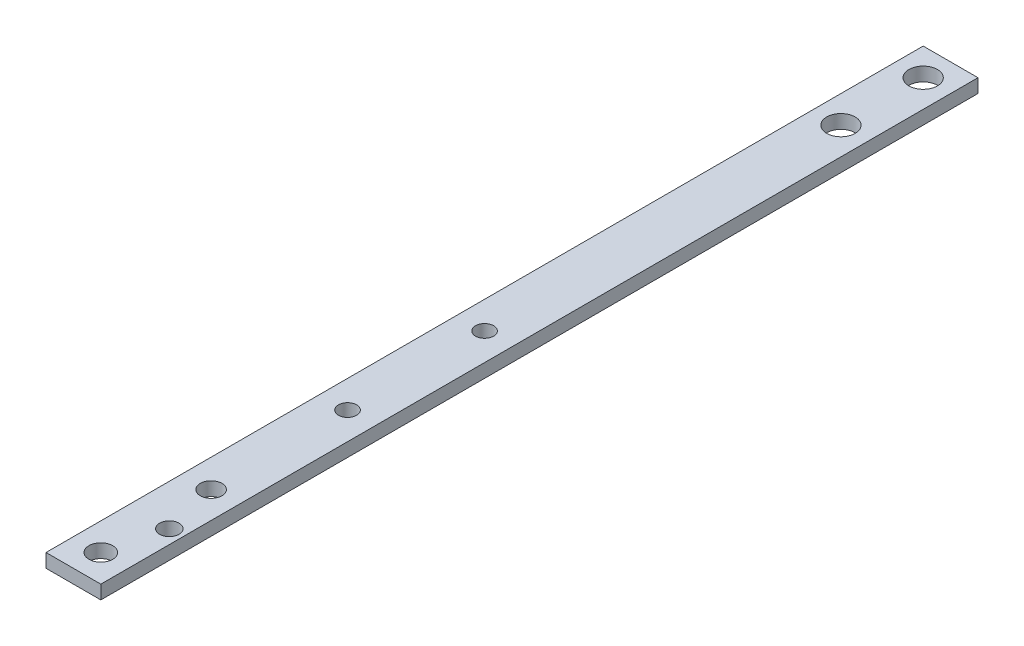
ISO-10303-21;
HEADER;
FILE_DESCRIPTION(('STEP AP214'),'2;1');
FILE_NAME('part.step','',(''),(''),'','','');
FILE_SCHEMA(('AUTOMOTIVE_DESIGN { 1 0 10303 214 1 1 1 1 }'));
ENDSEC;
DATA;
#1=APPLICATION_CONTEXT('core data for automotive mechanical design processes');
#2=APPLICATION_PROTOCOL_DEFINITION('international standard','automotive_design',2000,#1);
#3=PRODUCT_CONTEXT('',#1,'mechanical');
#4=PRODUCT('Part','Part','',(#3));
#5=PRODUCT_RELATED_PRODUCT_CATEGORY('part','',(#4));
#6=PRODUCT_DEFINITION_FORMATION('','',#4);
#7=PRODUCT_DEFINITION_CONTEXT('part definition',#1,'design');
#8=PRODUCT_DEFINITION('design','',#6,#7);
#9=PRODUCT_DEFINITION_SHAPE('','',#8);
#10=(LENGTH_UNIT() NAMED_UNIT(*) SI_UNIT(.MILLI.,.METRE.));
#11=(NAMED_UNIT(*) PLANE_ANGLE_UNIT() SI_UNIT($,.RADIAN.));
#12=(NAMED_UNIT(*) SI_UNIT($,.STERADIAN.) SOLID_ANGLE_UNIT());
#13=UNCERTAINTY_MEASURE_WITH_UNIT(LENGTH_MEASURE(1.E-05),#10,'distance_accuracy_value','');
#14=(GEOMETRIC_REPRESENTATION_CONTEXT(3) GLOBAL_UNCERTAINTY_ASSIGNED_CONTEXT((#13)) GLOBAL_UNIT_ASSIGNED_CONTEXT((#10,
#11,#12)) REPRESENTATION_CONTEXT('',''));
#15=CARTESIAN_POINT('',(0.,0.,0.));
#16=DIRECTION('',(0.,0.,1.));
#17=DIRECTION('',(1.,0.,0.));
#18=AXIS2_PLACEMENT_3D('',#15,#16,#17);
#19=CARTESIAN_POINT('',(0.,0.,203.2));
#20=DIRECTION('',(1.,0.,0.));
#21=DIRECTION('',(0.,0.,-1.));
#22=AXIS2_PLACEMENT_3D('',#19,#20,#21);
#23=PLANE('',#22);
#24=DIRECTION('',(0.,-1.,0.));
#25=VECTOR('',#24,1.);
#26=CARTESIAN_POINT('',(0.,0.,0.));
#27=LINE('',#26,#25);
#28=CARTESIAN_POINT('',(0.,3.175,0.));
#29=VERTEX_POINT('',#28);
#30=CARTESIAN_POINT('',(0.,0.,0.));
#31=VERTEX_POINT('',#30);
#32=EDGE_CURVE('E98',#29,#31,#27,.T.);
#33=ORIENTED_EDGE('',*,*,#32,.T.);
#34=DIRECTION('',(0.,0.,-1.));
#35=VECTOR('',#34,1.);
#36=CARTESIAN_POINT('',(0.,0.,203.2));
#37=LINE('',#36,#35);
#38=CARTESIAN_POINT('',(0.,0.,203.2));
#39=VERTEX_POINT('',#38);
#40=EDGE_CURVE('E11',#39,#31,#37,.T.);
#41=ORIENTED_EDGE('',*,*,#40,.F.);
#42=DIRECTION('',(0.,-1.,0.));
#43=VECTOR('',#42,1.);
#44=CARTESIAN_POINT('',(0.,0.,203.2));
#45=LINE('',#44,#43);
#46=CARTESIAN_POINT('',(0.,3.175,203.2));
#47=VERTEX_POINT('',#46);
#48=EDGE_CURVE('E86',#47,#39,#45,.T.);
#49=ORIENTED_EDGE('',*,*,#48,.F.);
#50=DIRECTION('',(0.,0.,-1.));
#51=VECTOR('',#50,1.);
#52=CARTESIAN_POINT('',(0.,3.175,203.2));
#53=LINE('',#52,#51);
#54=EDGE_CURVE('E94',#47,#29,#53,.T.);
#55=ORIENTED_EDGE('',*,*,#54,.T.);
#56=EDGE_LOOP('',(#33,#41,#49,#55));
#57=FACE_BOUND('',#56,.T.);
#58=ADVANCED_FACE('F35',(#57),#23,.F.);
#59=CARTESIAN_POINT('',(0.,0.,203.2));
#60=DIRECTION('',(0.,1.,0.));
#61=DIRECTION('',(0.,0.,1.));
#62=AXIS2_PLACEMENT_3D('',#59,#60,#61);
#63=PLANE('',#62);
#64=CARTESIAN_POINT('',(9.52500000000001,0.,184.15));
#65=DIRECTION('',(0.,-1.,0.));
#66=DIRECTION('',(0.,0.,-1.));
#67=AXIS2_PLACEMENT_3D('',#64,#65,#66);
#68=CIRCLE('',#67,2.24999999999999);
#69=CARTESIAN_POINT('',(9.52500000000001,0.,181.9));
#70=VERTEX_POINT('',#69);
#71=EDGE_CURVE('E150',#70,#70,#68,.T.);
#72=ORIENTED_EDGE('',*,*,#71,.F.);
#73=EDGE_LOOP('',(#72));
#74=FACE_BOUND('',#73,.T.);
#75=CARTESIAN_POINT('',(6.35,0.,196.85));
#76=DIRECTION('',(0.,1.,0.));
#77=DIRECTION('',(0.,0.,1.));
#78=AXIS2_PLACEMENT_3D('',#75,#76,#77);
#79=CIRCLE('',#78,2.75);
#80=CARTESIAN_POINT('',(6.35,0.,199.6));
#81=VERTEX_POINT('',#80);
#82=EDGE_CURVE('E141',#81,#81,#79,.T.);
#83=ORIENTED_EDGE('',*,*,#82,.T.);
#84=EDGE_LOOP('',(#83));
#85=FACE_BOUND('',#84,.T.);
#86=CARTESIAN_POINT('',(6.50670455281006,0.,171.45));
#87=DIRECTION('',(0.,1.,0.));
#88=DIRECTION('',(0.,0.,1.));
#89=AXIS2_PLACEMENT_3D('',#86,#87,#88);
#90=CIRCLE('',#89,2.5);
#91=CARTESIAN_POINT('',(6.50670455281006,0.,173.95));
#92=VERTEX_POINT('',#91);
#93=EDGE_CURVE('E135',#92,#92,#90,.T.);
#94=ORIENTED_EDGE('',*,*,#93,.T.);
#95=EDGE_LOOP('',(#94));
#96=FACE_BOUND('',#95,.T.);
#97=CARTESIAN_POINT('',(6.35,0.,139.7));
#98=DIRECTION('',(0.,-1.,0.));
#99=DIRECTION('',(0.,0.,-1.));
#100=AXIS2_PLACEMENT_3D('',#97,#98,#99);
#101=CIRCLE('',#100,2.09999999999999);
#102=CARTESIAN_POINT('',(6.35,0.,137.6));
#103=VERTEX_POINT('',#102);
#104=EDGE_CURVE('E132',#103,#103,#101,.T.);
#105=ORIENTED_EDGE('',*,*,#104,.F.);
#106=EDGE_LOOP('',(#105));
#107=FACE_BOUND('',#106,.T.);
#108=CARTESIAN_POINT('',(6.35,0.,107.95));
#109=DIRECTION('',(0.,-1.,0.));
#110=DIRECTION('',(0.,0.,-1.));
#111=AXIS2_PLACEMENT_3D('',#108,#109,#110);
#112=CIRCLE('',#111,2.09999999999999);
#113=CARTESIAN_POINT('',(6.35,0.,105.85));
#114=VERTEX_POINT('',#113);
#115=EDGE_CURVE('E126',#114,#114,#112,.T.);
#116=ORIENTED_EDGE('',*,*,#115,.F.);
#117=EDGE_LOOP('',(#116));
#118=FACE_BOUND('',#117,.T.);
#119=CARTESIAN_POINT('',(6.35,0.,6.35));
#120=DIRECTION('',(0.,-1.,0.));
#121=DIRECTION('',(0.,0.,-1.));
#122=AXIS2_PLACEMENT_3D('',#119,#120,#121);
#123=CIRCLE('',#122,3.29999999999999);
#124=CARTESIAN_POINT('',(6.35,0.,3.05000000000001));
#125=VERTEX_POINT('',#124);
#126=EDGE_CURVE('E120',#125,#125,#123,.T.);
#127=ORIENTED_EDGE('',*,*,#126,.F.);
#128=EDGE_LOOP('',(#127));
#129=FACE_BOUND('',#128,.T.);
#130=CARTESIAN_POINT('',(6.35,0.,25.4));
#131=DIRECTION('',(0.,-1.,0.));
#132=DIRECTION('',(0.,0.,-1.));
#133=AXIS2_PLACEMENT_3D('',#130,#131,#132);
#134=CIRCLE('',#133,3.29999999999999);
#135=CARTESIAN_POINT('',(6.35,0.,22.1));
#136=VERTEX_POINT('',#135);
#137=EDGE_CURVE('E114',#136,#136,#134,.T.);
#138=ORIENTED_EDGE('',*,*,#137,.F.);
#139=EDGE_LOOP('',(#138));
#140=FACE_BOUND('',#139,.T.);
#141=DIRECTION('',(1.,0.,0.));
#142=VECTOR('',#141,1.);
#143=CARTESIAN_POINT('',(0.,0.,0.));
#144=LINE('',#143,#142);
#145=CARTESIAN_POINT('',(12.7,0.,0.));
#146=VERTEX_POINT('',#145);
#147=EDGE_CURVE('E90',#31,#146,#144,.T.);
#148=ORIENTED_EDGE('',*,*,#147,.T.);
#149=DIRECTION('',(0.,0.,-1.));
#150=VECTOR('',#149,1.);
#151=CARTESIAN_POINT('',(12.7,0.,203.2));
#152=LINE('',#151,#150);
#153=CARTESIAN_POINT('',(12.7,0.,203.2));
#154=VERTEX_POINT('',#153);
#155=EDGE_CURVE('E43',#154,#146,#152,.T.);
#156=ORIENTED_EDGE('',*,*,#155,.F.);
#157=DIRECTION('',(1.,0.,0.));
#158=VECTOR('',#157,1.);
#159=CARTESIAN_POINT('',(0.,0.,203.2));
#160=LINE('',#159,#158);
#161=EDGE_CURVE('E81',#39,#154,#160,.T.);
#162=ORIENTED_EDGE('',*,*,#161,.F.);
#163=ORIENTED_EDGE('',*,*,#40,.T.);
#164=EDGE_LOOP('',(#148,#156,#162,#163));
#165=FACE_BOUND('',#164,.T.);
#166=ADVANCED_FACE('F89',(#74,#85,#96,#107,#118,#129,#140,#165),#63,.F.);
#167=CARTESIAN_POINT('',(12.7,0.,203.2));
#168=DIRECTION('',(-1.,0.,0.));
#169=DIRECTION('',(0.,0.,1.));
#170=AXIS2_PLACEMENT_3D('',#167,#168,#169);
#171=PLANE('',#170);
#172=DIRECTION('',(0.,1.,0.));
#173=VECTOR('',#172,1.);
#174=CARTESIAN_POINT('',(12.7,0.,0.));
#175=LINE('',#174,#173);
#176=CARTESIAN_POINT('',(12.7,3.175,0.));
#177=VERTEX_POINT('',#176);
#178=EDGE_CURVE('E68',#146,#177,#175,.T.);
#179=ORIENTED_EDGE('',*,*,#178,.T.);
#180=DIRECTION('',(0.,0.,-1.));
#181=VECTOR('',#180,1.);
#182=CARTESIAN_POINT('',(12.7,3.175,203.2));
#183=LINE('',#182,#181);
#184=CARTESIAN_POINT('',(12.7,3.175,203.2));
#185=VERTEX_POINT('',#184);
#186=EDGE_CURVE('E91',#185,#177,#183,.T.);
#187=ORIENTED_EDGE('',*,*,#186,.F.);
#188=DIRECTION('',(0.,1.,0.));
#189=VECTOR('',#188,1.);
#190=CARTESIAN_POINT('',(12.7,0.,203.2));
#191=LINE('',#190,#189);
#192=EDGE_CURVE('E84',#154,#185,#191,.T.);
#193=ORIENTED_EDGE('',*,*,#192,.F.);
#194=ORIENTED_EDGE('',*,*,#155,.T.);
#195=EDGE_LOOP('',(#179,#187,#193,#194));
#196=FACE_BOUND('',#195,.T.);
#197=ADVANCED_FACE('F92',(#196),#171,.F.);
#198=CARTESIAN_POINT('',(0.,3.175,203.2));
#199=DIRECTION('',(0.,-1.,0.));
#200=DIRECTION('',(0.,0.,-1.));
#201=AXIS2_PLACEMENT_3D('',#198,#199,#200);
#202=PLANE('',#201);
#203=CARTESIAN_POINT('',(9.52500000000001,3.175,184.15));
#204=DIRECTION('',(0.,-1.,0.));
#205=DIRECTION('',(0.,0.,-1.));
#206=AXIS2_PLACEMENT_3D('',#203,#204,#205);
#207=CIRCLE('',#206,2.24999999999999);
#208=CARTESIAN_POINT('',(9.52500000000001,3.175,181.9));
#209=VERTEX_POINT('',#208);
#210=EDGE_CURVE('E147',#209,#209,#207,.T.);
#211=ORIENTED_EDGE('',*,*,#210,.T.);
#212=EDGE_LOOP('',(#211));
#213=FACE_BOUND('',#212,.T.);
#214=CARTESIAN_POINT('',(6.35,3.175,196.85));
#215=DIRECTION('',(0.,1.,0.));
#216=DIRECTION('',(0.,0.,1.));
#217=AXIS2_PLACEMENT_3D('',#214,#215,#216);
#218=CIRCLE('',#217,2.75);
#219=CARTESIAN_POINT('',(6.35,3.175,199.6));
#220=VERTEX_POINT('',#219);
#221=EDGE_CURVE('E144',#220,#220,#218,.T.);
#222=ORIENTED_EDGE('',*,*,#221,.F.);
#223=EDGE_LOOP('',(#222));
#224=FACE_BOUND('',#223,.T.);
#225=CARTESIAN_POINT('',(6.50670455281006,3.175,171.45));
#226=DIRECTION('',(0.,1.,0.));
#227=DIRECTION('',(0.,0.,1.));
#228=AXIS2_PLACEMENT_3D('',#225,#226,#227);
#229=CIRCLE('',#228,2.5);
#230=CARTESIAN_POINT('',(6.50670455281006,3.175,173.95));
#231=VERTEX_POINT('',#230);
#232=EDGE_CURVE('E138',#231,#231,#229,.T.);
#233=ORIENTED_EDGE('',*,*,#232,.F.);
#234=EDGE_LOOP('',(#233));
#235=FACE_BOUND('',#234,.T.);
#236=CARTESIAN_POINT('',(6.35,3.175,139.7));
#237=DIRECTION('',(0.,-1.,0.));
#238=DIRECTION('',(0.,0.,-1.));
#239=AXIS2_PLACEMENT_3D('',#236,#237,#238);
#240=CIRCLE('',#239,2.1);
#241=CARTESIAN_POINT('',(6.35,3.175,137.6));
#242=VERTEX_POINT('',#241);
#243=EDGE_CURVE('E129',#242,#242,#240,.T.);
#244=ORIENTED_EDGE('',*,*,#243,.T.);
#245=EDGE_LOOP('',(#244));
#246=FACE_BOUND('',#245,.T.);
#247=CARTESIAN_POINT('',(6.35,3.175,107.95));
#248=DIRECTION('',(0.,-1.,0.));
#249=DIRECTION('',(0.,0.,-1.));
#250=AXIS2_PLACEMENT_3D('',#247,#248,#249);
#251=CIRCLE('',#250,2.1);
#252=CARTESIAN_POINT('',(6.35,3.175,105.85));
#253=VERTEX_POINT('',#252);
#254=EDGE_CURVE('E123',#253,#253,#251,.T.);
#255=ORIENTED_EDGE('',*,*,#254,.T.);
#256=EDGE_LOOP('',(#255));
#257=FACE_BOUND('',#256,.T.);
#258=CARTESIAN_POINT('',(6.35,3.175,6.35));
#259=DIRECTION('',(0.,-1.,0.));
#260=DIRECTION('',(0.,0.,-1.));
#261=AXIS2_PLACEMENT_3D('',#258,#259,#260);
#262=CIRCLE('',#261,3.3);
#263=CARTESIAN_POINT('',(6.35,3.175,3.05));
#264=VERTEX_POINT('',#263);
#265=EDGE_CURVE('E117',#264,#264,#262,.T.);
#266=ORIENTED_EDGE('',*,*,#265,.T.);
#267=EDGE_LOOP('',(#266));
#268=FACE_BOUND('',#267,.T.);
#269=CARTESIAN_POINT('',(6.35,3.175,25.4));
#270=DIRECTION('',(0.,-1.,0.));
#271=DIRECTION('',(0.,0.,-1.));
#272=AXIS2_PLACEMENT_3D('',#269,#270,#271);
#273=CIRCLE('',#272,3.3);
#274=CARTESIAN_POINT('',(6.35,3.175,22.1));
#275=VERTEX_POINT('',#274);
#276=EDGE_CURVE('E101',#275,#275,#273,.T.);
#277=ORIENTED_EDGE('',*,*,#276,.T.);
#278=EDGE_LOOP('',(#277));
#279=FACE_BOUND('',#278,.T.);
#280=DIRECTION('',(-1.,0.,0.));
#281=VECTOR('',#280,1.);
#282=CARTESIAN_POINT('',(0.,3.175,0.));
#283=LINE('',#282,#281);
#284=EDGE_CURVE('E74',#177,#29,#283,.T.);
#285=ORIENTED_EDGE('',*,*,#284,.T.);
#286=ORIENTED_EDGE('',*,*,#54,.F.);
#287=DIRECTION('',(-1.,0.,0.));
#288=VECTOR('',#287,1.);
#289=CARTESIAN_POINT('',(0.,3.175,203.2));
#290=LINE('',#289,#288);
#291=EDGE_CURVE('E51',#185,#47,#290,.T.);
#292=ORIENTED_EDGE('',*,*,#291,.F.);
#293=ORIENTED_EDGE('',*,*,#186,.T.);
#294=EDGE_LOOP('',(#285,#286,#292,#293));
#295=FACE_BOUND('',#294,.T.);
#296=ADVANCED_FACE('F106',(#213,#224,#235,#246,#257,#268,#279,#295),#202,.F.);
#297=CARTESIAN_POINT('',(0.,0.,203.2));
#298=DIRECTION('',(0.,0.,-1.));
#299=DIRECTION('',(-1.,0.,0.));
#300=AXIS2_PLACEMENT_3D('',#297,#298,#299);
#301=PLANE('',#300);
#302=ORIENTED_EDGE('',*,*,#48,.T.);
#303=ORIENTED_EDGE('',*,*,#161,.T.);
#304=ORIENTED_EDGE('',*,*,#192,.T.);
#305=ORIENTED_EDGE('',*,*,#291,.T.);
#306=EDGE_LOOP('',(#302,#303,#304,#305));
#307=FACE_BOUND('',#306,.T.);
#308=ADVANCED_FACE('F82',(#307),#301,.F.);
#309=CARTESIAN_POINT('',(0.,0.,0.));
#310=DIRECTION('',(0.,0.,-1.));
#311=DIRECTION('',(-1.,0.,0.));
#312=AXIS2_PLACEMENT_3D('',#309,#310,#311);
#313=PLANE('',#312);
#314=ORIENTED_EDGE('',*,*,#32,.F.);
#315=ORIENTED_EDGE('',*,*,#284,.F.);
#316=ORIENTED_EDGE('',*,*,#178,.F.);
#317=ORIENTED_EDGE('',*,*,#147,.F.);
#318=EDGE_LOOP('',(#314,#315,#316,#317));
#319=FACE_BOUND('',#318,.T.);
#320=ADVANCED_FACE('F109',(#319),#313,.T.);
#321=CARTESIAN_POINT('',(6.35,0.,25.4));
#322=DIRECTION('',(0.,-1.,0.));
#323=DIRECTION('',(0.,0.,-1.));
#324=AXIS2_PLACEMENT_3D('',#321,#322,#323);
#325=CYLINDRICAL_SURFACE('',#324,3.29999999999999);
#326=ORIENTED_EDGE('',*,*,#276,.F.);
#327=EDGE_LOOP('',(#326));
#328=FACE_BOUND('',#327,.T.);
#329=ORIENTED_EDGE('',*,*,#137,.T.);
#330=EDGE_LOOP('',(#329));
#331=FACE_BOUND('',#330,.T.);
#332=ADVANCED_FACE('F170',(#328,#331),#325,.F.);
#333=CARTESIAN_POINT('',(6.35,0.,6.35));
#334=DIRECTION('',(0.,-1.,0.));
#335=DIRECTION('',(0.,0.,-1.));
#336=AXIS2_PLACEMENT_3D('',#333,#334,#335);
#337=CYLINDRICAL_SURFACE('',#336,3.29999999999999);
#338=ORIENTED_EDGE('',*,*,#265,.F.);
#339=EDGE_LOOP('',(#338));
#340=FACE_BOUND('',#339,.T.);
#341=ORIENTED_EDGE('',*,*,#126,.T.);
#342=EDGE_LOOP('',(#341));
#343=FACE_BOUND('',#342,.T.);
#344=ADVANCED_FACE('F172',(#340,#343),#337,.F.);
#345=CARTESIAN_POINT('',(6.35,0.,107.95));
#346=DIRECTION('',(0.,-1.,0.));
#347=DIRECTION('',(0.,0.,-1.));
#348=AXIS2_PLACEMENT_3D('',#345,#346,#347);
#349=CYLINDRICAL_SURFACE('',#348,2.09999999999999);
#350=ORIENTED_EDGE('',*,*,#254,.F.);
#351=EDGE_LOOP('',(#350));
#352=FACE_BOUND('',#351,.T.);
#353=ORIENTED_EDGE('',*,*,#115,.T.);
#354=EDGE_LOOP('',(#353));
#355=FACE_BOUND('',#354,.T.);
#356=ADVANCED_FACE('F179',(#352,#355),#349,.F.);
#357=CARTESIAN_POINT('',(6.35,0.,139.7));
#358=DIRECTION('',(0.,-1.,0.));
#359=DIRECTION('',(0.,0.,-1.));
#360=AXIS2_PLACEMENT_3D('',#357,#358,#359);
#361=CYLINDRICAL_SURFACE('',#360,2.09999999999999);
#362=ORIENTED_EDGE('',*,*,#243,.F.);
#363=EDGE_LOOP('',(#362));
#364=FACE_BOUND('',#363,.T.);
#365=ORIENTED_EDGE('',*,*,#104,.T.);
#366=EDGE_LOOP('',(#365));
#367=FACE_BOUND('',#366,.T.);
#368=ADVANCED_FACE('F235',(#364,#367),#361,.F.);
#369=CARTESIAN_POINT('',(6.50670455281006,3.175,171.45));
#370=DIRECTION('',(0.,1.,0.));
#371=DIRECTION('',(0.,0.,1.));
#372=AXIS2_PLACEMENT_3D('',#369,#370,#371);
#373=CYLINDRICAL_SURFACE('',#372,2.5);
#374=ORIENTED_EDGE('',*,*,#93,.F.);
#375=EDGE_LOOP('',(#374));
#376=FACE_BOUND('',#375,.T.);
#377=ORIENTED_EDGE('',*,*,#232,.T.);
#378=EDGE_LOOP('',(#377));
#379=FACE_BOUND('',#378,.T.);
#380=ADVANCED_FACE('F245',(#376,#379),#373,.F.);
#381=CARTESIAN_POINT('',(6.35,3.175,196.85));
#382=DIRECTION('',(0.,1.,0.));
#383=DIRECTION('',(0.,0.,1.));
#384=AXIS2_PLACEMENT_3D('',#381,#382,#383);
#385=CYLINDRICAL_SURFACE('',#384,2.75);
#386=ORIENTED_EDGE('',*,*,#82,.F.);
#387=EDGE_LOOP('',(#386));
#388=FACE_BOUND('',#387,.T.);
#389=ORIENTED_EDGE('',*,*,#221,.T.);
#390=EDGE_LOOP('',(#389));
#391=FACE_BOUND('',#390,.T.);
#392=ADVANCED_FACE('F254',(#388,#391),#385,.F.);
#393=CARTESIAN_POINT('',(9.52500000000001,0.,184.15));
#394=DIRECTION('',(0.,-1.,0.));
#395=DIRECTION('',(0.,0.,-1.));
#396=AXIS2_PLACEMENT_3D('',#393,#394,#395);
#397=CYLINDRICAL_SURFACE('',#396,2.24999999999999);
#398=ORIENTED_EDGE('',*,*,#210,.F.);
#399=EDGE_LOOP('',(#398));
#400=FACE_BOUND('',#399,.T.);
#401=ORIENTED_EDGE('',*,*,#71,.T.);
#402=EDGE_LOOP('',(#401));
#403=FACE_BOUND('',#402,.T.);
#404=ADVANCED_FACE('F154',(#400,#403),#397,.F.);
#405=CLOSED_SHELL('',(#58,#166,#197,#296,#308,#320,#332,#344,#356,#368,#380,#392,#404));
#406=MANIFOLD_SOLID_BREP('B2',#405);
#407=ADVANCED_BREP_SHAPE_REPRESENTATION('',(#18,#406),#14);
#408=SHAPE_DEFINITION_REPRESENTATION(#9,#407);
ENDSEC;
END-ISO-10303-21;
